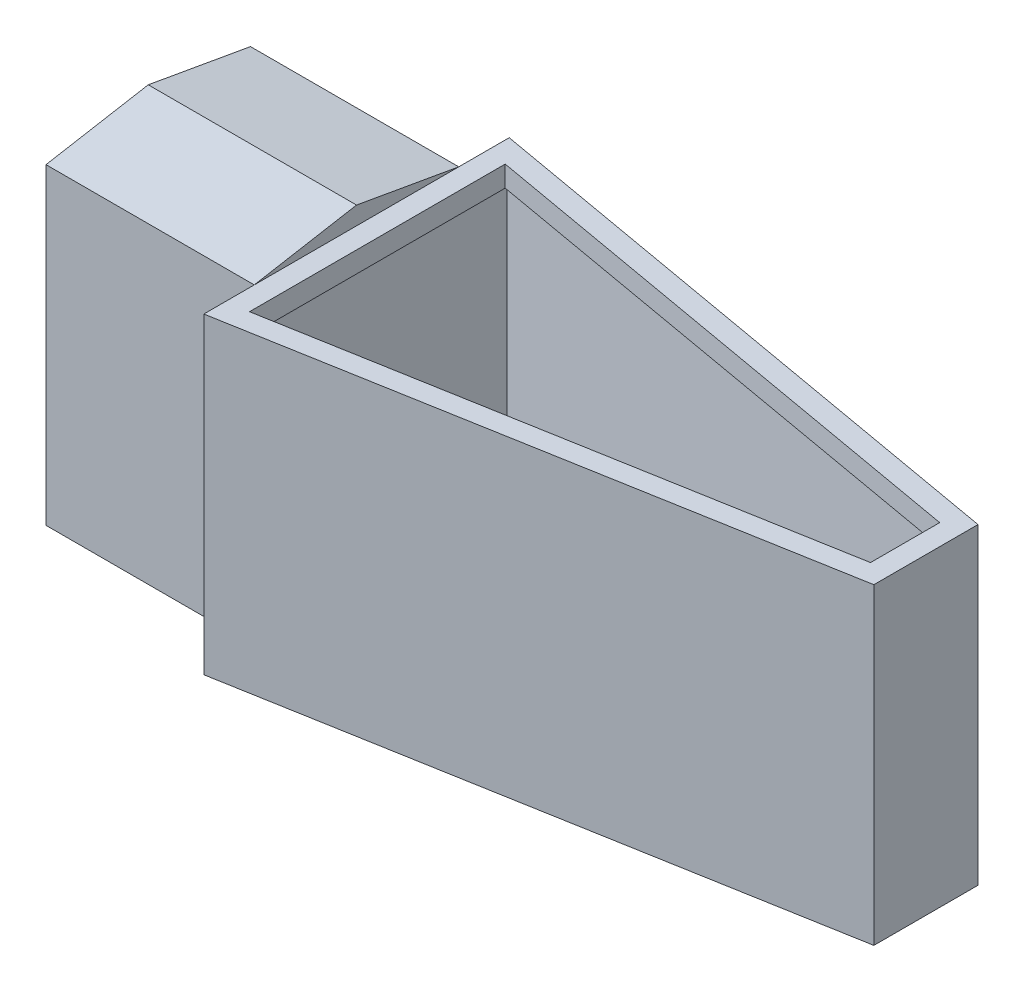
ISO-10303-21;
HEADER;
FILE_DESCRIPTION(('STEP AP214'),'2;1');
FILE_NAME('part.step','',(''),(''),'','','');
FILE_SCHEMA(('AUTOMOTIVE_DESIGN { 1 0 10303 214 1 1 1 1 }'));
ENDSEC;
DATA;
#1=APPLICATION_CONTEXT('core data for automotive mechanical design processes');
#2=APPLICATION_PROTOCOL_DEFINITION('international standard','automotive_design',2000,#1);
#3=PRODUCT_CONTEXT('',#1,'mechanical');
#4=PRODUCT('Part','Part','',(#3));
#5=PRODUCT_RELATED_PRODUCT_CATEGORY('part','',(#4));
#6=PRODUCT_DEFINITION_FORMATION('','',#4);
#7=PRODUCT_DEFINITION_CONTEXT('part definition',#1,'design');
#8=PRODUCT_DEFINITION('design','',#6,#7);
#9=PRODUCT_DEFINITION_SHAPE('','',#8);
#10=(LENGTH_UNIT() NAMED_UNIT(*) SI_UNIT(.MILLI.,.METRE.));
#11=(NAMED_UNIT(*) PLANE_ANGLE_UNIT() SI_UNIT($,.RADIAN.));
#12=(NAMED_UNIT(*) SI_UNIT($,.STERADIAN.) SOLID_ANGLE_UNIT());
#13=UNCERTAINTY_MEASURE_WITH_UNIT(LENGTH_MEASURE(1.E-05),#10,'distance_accuracy_value','');
#14=(GEOMETRIC_REPRESENTATION_CONTEXT(3) GLOBAL_UNCERTAINTY_ASSIGNED_CONTEXT((#13)) GLOBAL_UNIT_ASSIGNED_CONTEXT((#10,
#11,#12)) REPRESENTATION_CONTEXT('',''));
#15=CARTESIAN_POINT('',(0.,0.,0.));
#16=DIRECTION('',(0.,0.,1.));
#17=DIRECTION('',(1.,0.,0.));
#18=AXIS2_PLACEMENT_3D('',#15,#16,#17);
#19=CARTESIAN_POINT('',(12.8538089551144,38.1,-0.174987325087056));
#20=DIRECTION('',(1.,0.,0.));
#21=DIRECTION('',(0.,0.,-1.));
#22=AXIS2_PLACEMENT_3D('',#19,#20,#21);
#23=PLANE('',#22);
#24=DIRECTION('',(0.,-1.,0.));
#25=VECTOR('',#24,1.);
#26=CARTESIAN_POINT('',(12.8538089551144,0.,-31.26502256));
#27=LINE('',#26,#25);
#28=CARTESIAN_POINT('',(12.8538089551144,38.1,-31.26502256));
#29=VERTEX_POINT('',#28);
#30=CARTESIAN_POINT('',(12.8538089551144,0.,-31.2650225599999));
#31=VERTEX_POINT('',#30);
#32=EDGE_CURVE('E54',#29,#31,#27,.T.);
#33=ORIENTED_EDGE('',*,*,#32,.F.);
#34=DIRECTION('',(0.,0.,1.));
#35=VECTOR('',#34,1.);
#36=CARTESIAN_POINT('',(12.8538089551144,38.1,-0.174987325087056));
#37=LINE('',#36,#35);
#38=CARTESIAN_POINT('',(12.8538089551144,38.1,-37.417012674913));
#39=VERTEX_POINT('',#38);
#40=EDGE_CURVE('E286',#39,#29,#37,.T.);
#41=ORIENTED_EDGE('',*,*,#40,.F.);
#42=DIRECTION('',(0.,-1.,0.));
#43=VECTOR('',#42,1.);
#44=CARTESIAN_POINT('',(12.8538089551144,38.1,-37.417012674913));
#45=LINE('',#44,#43);
#46=CARTESIAN_POINT('',(12.8538089551144,0.,-37.417012674913));
#47=VERTEX_POINT('',#46);
#48=EDGE_CURVE('E12',#39,#47,#45,.T.);
#49=ORIENTED_EDGE('',*,*,#48,.T.);
#50=DIRECTION('',(0.,0.,1.));
#51=VECTOR('',#50,1.);
#52=CARTESIAN_POINT('',(12.8538089551144,0.,-0.174987325087056));
#53=LINE('',#52,#51);
#54=EDGE_CURVE('E298',#47,#31,#53,.T.);
#55=ORIENTED_EDGE('',*,*,#54,.T.);
#56=EDGE_LOOP('',(#33,#41,#49,#55));
#57=FACE_BOUND('',#56,.T.);
#58=ADVANCED_FACE('F39',(#57),#23,.F.);
#59=DIRECTION('',(0.,1.,0.));
#60=VECTOR('',#59,1.);
#61=CARTESIAN_POINT('',(12.8538089551144,0.,-6.32697744));
#62=LINE('',#61,#60);
#63=CARTESIAN_POINT('',(12.8538089551144,0.,-6.32697744));
#64=VERTEX_POINT('',#63);
#65=CARTESIAN_POINT('',(12.8538089551144,38.1,-6.32697744));
#66=VERTEX_POINT('',#65);
#67=EDGE_CURVE('E203',#64,#66,#62,.T.);
#68=ORIENTED_EDGE('',*,*,#67,.F.);
#69=CARTESIAN_POINT('',(12.8538089551144,0.,-0.174987325087056));
#70=VERTEX_POINT('',#69);
#71=EDGE_CURVE('E297',#64,#70,#53,.T.);
#72=ORIENTED_EDGE('',*,*,#71,.T.);
#73=DIRECTION('',(0.,-1.,0.));
#74=VECTOR('',#73,1.);
#75=CARTESIAN_POINT('',(12.8538089551144,38.1,-0.174987325087056));
#76=LINE('',#75,#74);
#77=CARTESIAN_POINT('',(12.8538089551144,38.1,-0.174987325087056));
#78=VERTEX_POINT('',#77);
#79=EDGE_CURVE('E47',#78,#70,#76,.T.);
#80=ORIENTED_EDGE('',*,*,#79,.F.);
#81=EDGE_CURVE('E284',#66,#78,#37,.T.);
#82=ORIENTED_EDGE('',*,*,#81,.F.);
#83=EDGE_LOOP('',(#68,#72,#80,#82));
#84=FACE_BOUND('',#83,.T.);
#85=ADVANCED_FACE('F337',(#84),#23,.F.);
#86=CARTESIAN_POINT('',(0.,38.1,0.));
#87=DIRECTION('',(0.,-1.,0.));
#88=DIRECTION('',(0.,0.,-1.));
#89=AXIS2_PLACEMENT_3D('',#86,#87,#88);
#90=PLANE('',#89);
#91=DIRECTION('',(-0.984743468318978,0.,-0.174012360489451));
#92=VECTOR('',#91,1.);
#93=CARTESIAN_POINT('',(82.2959999999999,38.1,-25.146));
#94=LINE('',#93,#92);
#95=CARTESIAN_POINT('',(82.2959999999999,38.1,-25.146));
#96=VERTEX_POINT('',#95);
#97=EDGE_CURVE('E281',#96,#39,#94,.T.);
#98=ORIENTED_EDGE('',*,*,#97,.T.);
#99=ORIENTED_EDGE('',*,*,#40,.T.);
#100=EDGE_CURVE('E290',#29,#66,#37,.T.);
#101=ORIENTED_EDGE('',*,*,#100,.T.);
#102=ORIENTED_EDGE('',*,*,#81,.T.);
#103=DIRECTION('',(0.984743468318978,0.,-0.17401236048945));
#104=VECTOR('',#103,1.);
#105=CARTESIAN_POINT('',(82.2959999999999,38.1,-12.446));
#106=LINE('',#105,#104);
#107=CARTESIAN_POINT('',(82.2959999999999,38.1,-12.446));
#108=VERTEX_POINT('',#107);
#109=EDGE_CURVE('E289',#78,#108,#106,.T.);
#110=ORIENTED_EDGE('',*,*,#109,.T.);
#111=DIRECTION('',(0.,0.,-1.));
#112=VECTOR('',#111,1.);
#113=CARTESIAN_POINT('',(82.2959999999999,38.1,-12.446));
#114=LINE('',#113,#112);
#115=EDGE_CURVE('E292',#108,#96,#114,.T.);
#116=ORIENTED_EDGE('',*,*,#115,.T.);
#117=EDGE_LOOP('',(#98,#99,#101,#102,#110,#116));
#118=FACE_BOUND('',#117,.T.);
#119=DIRECTION('',(0.,0.,-1.));
#120=VECTOR('',#119,1.);
#121=CARTESIAN_POINT('',(15.3938089551144,38.1,-34.3888215859853));
#122=LINE('',#121,#120);
#123=CARTESIAN_POINT('',(15.3938089551144,38.1,-3.20317841401467));
#124=VERTEX_POINT('',#123);
#125=CARTESIAN_POINT('',(15.3938089551144,38.1,-34.3888215859853));
#126=VERTEX_POINT('',#125);
#127=EDGE_CURVE('E255',#124,#126,#122,.T.);
#128=ORIENTED_EDGE('',*,*,#127,.T.);
#129=DIRECTION('',(0.984743468318978,0.,0.174012360489451));
#130=VECTOR('',#129,1.);
#131=CARTESIAN_POINT('',(79.7559999999999,38.1,-23.0154871589875));
#132=LINE('',#131,#130);
#133=CARTESIAN_POINT('',(79.7559999999999,38.1,-23.0154871589875));
#134=VERTEX_POINT('',#133);
#135=EDGE_CURVE('E251',#126,#134,#132,.T.);
#136=ORIENTED_EDGE('',*,*,#135,.T.);
#137=DIRECTION('',(0.,0.,1.));
#138=VECTOR('',#137,1.);
#139=CARTESIAN_POINT('',(79.7559999999999,38.1,-14.5765128410125));
#140=LINE('',#139,#138);
#141=CARTESIAN_POINT('',(79.7559999999999,38.1,-14.5765128410125));
#142=VERTEX_POINT('',#141);
#143=EDGE_CURVE('E254',#134,#142,#140,.T.);
#144=ORIENTED_EDGE('',*,*,#143,.T.);
#145=DIRECTION('',(-0.984743468318978,0.,0.17401236048945));
#146=VECTOR('',#145,1.);
#147=CARTESIAN_POINT('',(15.3938089551144,38.1,-3.20317841401467));
#148=LINE('',#147,#146);
#149=EDGE_CURVE('E258',#142,#124,#148,.T.);
#150=ORIENTED_EDGE('',*,*,#149,.T.);
#151=EDGE_LOOP('',(#128,#136,#144,#150));
#152=FACE_BOUND('',#151,.T.);
#153=ADVANCED_FACE('F333',(#118,#152),#90,.F.);
#154=CARTESIAN_POINT('',(82.2959999999999,38.1,-25.146));
#155=DIRECTION('',(-0.174012360489451,0.,0.984743468318978));
#156=DIRECTION('',(0.984743468318978,0.,0.174012360489451));
#157=AXIS2_PLACEMENT_3D('',#154,#155,#156);
#158=PLANE('',#157);
#159=DIRECTION('',(-0.984743468318978,0.,-0.174012360489451));
#160=VECTOR('',#159,1.);
#161=CARTESIAN_POINT('',(82.2959999999999,0.,-25.146));
#162=LINE('',#161,#160);
#163=CARTESIAN_POINT('',(82.2959999999999,0.,-25.146));
#164=VERTEX_POINT('',#163);
#165=EDGE_CURVE('E261',#164,#47,#162,.T.);
#166=ORIENTED_EDGE('',*,*,#165,.T.);
#167=ORIENTED_EDGE('',*,*,#48,.F.);
#168=ORIENTED_EDGE('',*,*,#97,.F.);
#169=DIRECTION('',(0.,-1.,0.));
#170=VECTOR('',#169,1.);
#171=CARTESIAN_POINT('',(82.2959999999999,38.1,-25.146));
#172=LINE('',#171,#170);
#173=EDGE_CURVE('E294',#96,#164,#172,.T.);
#174=ORIENTED_EDGE('',*,*,#173,.T.);
#175=EDGE_LOOP('',(#166,#167,#168,#174));
#176=FACE_BOUND('',#175,.T.);
#177=ADVANCED_FACE('F41',(#176),#158,.F.);
#178=EDGE_CURVE('E302',#31,#64,#53,.T.);
#179=ORIENTED_EDGE('',*,*,#178,.T.);
#180=DIRECTION('',(0.,0.173648177666934,-0.984807753012208));
#181=VECTOR('',#180,1.);
#182=CARTESIAN_POINT('',(12.8538089551144,-1.08197686542356,-0.19078171387655));
#183=LINE('',#182,#181);
#184=CARTESIAN_POINT('',(12.8538089551144,2.19862510039056,-18.7959999999999));
#185=VERTEX_POINT('',#184);
#186=EDGE_CURVE('E200',#64,#185,#183,.T.);
#187=ORIENTED_EDGE('',*,*,#186,.T.);
#188=DIRECTION('',(0.,-0.173648177666931,-0.984807753012208));
#189=VECTOR('',#188,1.);
#190=CARTESIAN_POINT('',(12.8538089551144,5.34663374852575,-0.942755785831534));
#191=LINE('',#190,#189);
#192=EDGE_CURVE('E198',#185,#31,#191,.T.);
#193=ORIENTED_EDGE('',*,*,#192,.T.);
#194=EDGE_LOOP('',(#179,#187,#193));
#195=FACE_BOUND('',#194,.T.);
#196=ADVANCED_FACE('F355',(#195),#23,.F.);
#197=CARTESIAN_POINT('',(82.2959999999999,38.1,-12.446));
#198=DIRECTION('',(-0.17401236048945,0.,-0.984743468318978));
#199=DIRECTION('',(-0.984743468318978,0.,0.17401236048945));
#200=AXIS2_PLACEMENT_3D('',#197,#198,#199);
#201=PLANE('',#200);
#202=DIRECTION('',(0.984743468318978,0.,-0.17401236048945));
#203=VECTOR('',#202,1.);
#204=CARTESIAN_POINT('',(82.2959999999999,0.,-12.446));
#205=LINE('',#204,#203);
#206=CARTESIAN_POINT('',(82.2959999999999,0.,-12.446));
#207=VERTEX_POINT('',#206);
#208=EDGE_CURVE('E301',#70,#207,#205,.T.);
#209=ORIENTED_EDGE('',*,*,#208,.T.);
#210=DIRECTION('',(0.,-1.,0.));
#211=VECTOR('',#210,1.);
#212=CARTESIAN_POINT('',(82.2959999999999,38.1,-12.446));
#213=LINE('',#212,#211);
#214=EDGE_CURVE('E307',#108,#207,#213,.T.);
#215=ORIENTED_EDGE('',*,*,#214,.F.);
#216=ORIENTED_EDGE('',*,*,#109,.F.);
#217=ORIENTED_EDGE('',*,*,#79,.T.);
#218=EDGE_LOOP('',(#209,#215,#216,#217));
#219=FACE_BOUND('',#218,.T.);
#220=ADVANCED_FACE('F314',(#219),#201,.F.);
#221=CARTESIAN_POINT('',(82.2959999999999,38.1,-12.446));
#222=DIRECTION('',(-1.,0.,0.));
#223=DIRECTION('',(0.,0.,1.));
#224=AXIS2_PLACEMENT_3D('',#221,#222,#223);
#225=PLANE('',#224);
#226=DIRECTION('',(0.,0.,-1.));
#227=VECTOR('',#226,1.);
#228=CARTESIAN_POINT('',(82.2959999999999,0.,-12.446));
#229=LINE('',#228,#227);
#230=EDGE_CURVE('E285',#207,#164,#229,.T.);
#231=ORIENTED_EDGE('',*,*,#230,.T.);
#232=ORIENTED_EDGE('',*,*,#173,.F.);
#233=ORIENTED_EDGE('',*,*,#115,.F.);
#234=ORIENTED_EDGE('',*,*,#214,.T.);
#235=EDGE_LOOP('',(#231,#232,#233,#234));
#236=FACE_BOUND('',#235,.T.);
#237=ADVANCED_FACE('F327',(#236),#225,.F.);
#238=CARTESIAN_POINT('',(0.,0.,0.));
#239=DIRECTION('',(0.,-1.,0.));
#240=DIRECTION('',(0.,0.,-1.));
#241=AXIS2_PLACEMENT_3D('',#238,#239,#240);
#242=PLANE('',#241);
#243=ORIENTED_EDGE('',*,*,#165,.F.);
#244=ORIENTED_EDGE('',*,*,#230,.F.);
#245=ORIENTED_EDGE('',*,*,#208,.F.);
#246=ORIENTED_EDGE('',*,*,#71,.F.);
#247=ORIENTED_EDGE('',*,*,#178,.F.);
#248=ORIENTED_EDGE('',*,*,#54,.F.);
#249=EDGE_LOOP('',(#243,#244,#245,#246,#247,#248));
#250=FACE_BOUND('',#249,.T.);
#251=ADVANCED_FACE('F322',(#250),#242,.T.);
#252=CARTESIAN_POINT('',(15.3938089551144,109.619479697127,-34.3888215859853));
#253=DIRECTION('',(1.,0.,0.));
#254=DIRECTION('',(0.,0.,-1.));
#255=AXIS2_PLACEMENT_3D('',#252,#253,#254);
#256=PLANE('',#255);
#257=DIRECTION('',(0.,-1.,0.));
#258=VECTOR('',#257,1.);
#259=CARTESIAN_POINT('',(15.3938089551144,109.619479697127,-3.20317841401467));
#260=LINE('',#259,#258);
#261=CARTESIAN_POINT('',(15.3938089551144,35.56,-3.20317841401467));
#262=VERTEX_POINT('',#261);
#263=EDGE_CURVE('E62',#124,#262,#260,.T.);
#264=ORIENTED_EDGE('',*,*,#263,.T.);
#265=DIRECTION('',(0.,0.,1.));
#266=VECTOR('',#265,1.);
#267=CARTESIAN_POINT('',(15.3938089551144,35.56,-34.3888215859853));
#268=LINE('',#267,#266);
#269=CARTESIAN_POINT('',(15.3938089551144,35.56,-34.3888215859853));
#270=VERTEX_POINT('',#269);
#271=EDGE_CURVE('E267',#270,#262,#268,.T.);
#272=ORIENTED_EDGE('',*,*,#271,.F.);
#273=DIRECTION('',(0.,-1.,0.));
#274=VECTOR('',#273,1.);
#275=CARTESIAN_POINT('',(15.3938089551144,109.619479697127,-34.3888215859853));
#276=LINE('',#275,#274);
#277=EDGE_CURVE('E270',#126,#270,#276,.T.);
#278=ORIENTED_EDGE('',*,*,#277,.F.);
#279=ORIENTED_EDGE('',*,*,#127,.F.);
#280=EDGE_LOOP('',(#264,#272,#278,#279));
#281=FACE_BOUND('',#280,.T.);
#282=ADVANCED_FACE('F389',(#281),#256,.T.);
#283=CARTESIAN_POINT('',(79.7559999999999,109.619479697127,-23.0154871589875));
#284=DIRECTION('',(-0.174012360489451,0.,0.984743468318978));
#285=DIRECTION('',(0.984743468318978,0.,0.174012360489451));
#286=AXIS2_PLACEMENT_3D('',#283,#284,#285);
#287=PLANE('',#286);
#288=ORIENTED_EDGE('',*,*,#277,.T.);
#289=DIRECTION('',(-0.984743468318978,0.,-0.174012360489451));
#290=VECTOR('',#289,1.);
#291=CARTESIAN_POINT('',(79.7559999999999,35.56,-23.0154871589875));
#292=LINE('',#291,#290);
#293=CARTESIAN_POINT('',(79.7559999999999,35.56,-23.0154871589875));
#294=VERTEX_POINT('',#293);
#295=EDGE_CURVE('E265',#294,#270,#292,.T.);
#296=ORIENTED_EDGE('',*,*,#295,.F.);
#297=DIRECTION('',(0.,-1.,0.));
#298=VECTOR('',#297,1.);
#299=CARTESIAN_POINT('',(79.7559999999999,109.619479697127,-23.0154871589875));
#300=LINE('',#299,#298);
#301=EDGE_CURVE('E273',#134,#294,#300,.T.);
#302=ORIENTED_EDGE('',*,*,#301,.F.);
#303=ORIENTED_EDGE('',*,*,#135,.F.);
#304=EDGE_LOOP('',(#288,#296,#302,#303));
#305=FACE_BOUND('',#304,.T.);
#306=ADVANCED_FACE('F409',(#305),#287,.T.);
#307=CARTESIAN_POINT('',(79.7559999999999,109.619479697127,-14.5765128410125));
#308=DIRECTION('',(-1.,0.,0.));
#309=DIRECTION('',(0.,0.,1.));
#310=AXIS2_PLACEMENT_3D('',#307,#308,#309);
#311=PLANE('',#310);
#312=ORIENTED_EDGE('',*,*,#301,.T.);
#313=DIRECTION('',(0.,0.,-1.));
#314=VECTOR('',#313,1.);
#315=CARTESIAN_POINT('',(79.7559999999999,35.56,-14.5765128410125));
#316=LINE('',#315,#314);
#317=CARTESIAN_POINT('',(79.7559999999999,35.56,-14.5765128410125));
#318=VERTEX_POINT('',#317);
#319=EDGE_CURVE('E263',#318,#294,#316,.T.);
#320=ORIENTED_EDGE('',*,*,#319,.F.);
#321=DIRECTION('',(0.,-1.,0.));
#322=VECTOR('',#321,1.);
#323=CARTESIAN_POINT('',(79.7559999999999,109.619479697127,-14.5765128410125));
#324=LINE('',#323,#322);
#325=EDGE_CURVE('E276',#142,#318,#324,.T.);
#326=ORIENTED_EDGE('',*,*,#325,.F.);
#327=ORIENTED_EDGE('',*,*,#143,.F.);
#328=EDGE_LOOP('',(#312,#320,#326,#327));
#329=FACE_BOUND('',#328,.T.);
#330=ADVANCED_FACE('F417',(#329),#311,.T.);
#331=CARTESIAN_POINT('',(15.3938089551144,109.619479697127,-3.20317841401467));
#332=DIRECTION('',(-0.17401236048945,0.,-0.984743468318978));
#333=DIRECTION('',(-0.984743468318978,0.,0.17401236048945));
#334=AXIS2_PLACEMENT_3D('',#331,#332,#333);
#335=PLANE('',#334);
#336=ORIENTED_EDGE('',*,*,#325,.T.);
#337=DIRECTION('',(0.984743468318978,0.,-0.17401236048945));
#338=VECTOR('',#337,1.);
#339=CARTESIAN_POINT('',(15.3938089551144,35.56,-3.20317841401467));
#340=LINE('',#339,#338);
#341=EDGE_CURVE('E250',#262,#318,#340,.T.);
#342=ORIENTED_EDGE('',*,*,#341,.F.);
#343=ORIENTED_EDGE('',*,*,#263,.F.);
#344=ORIENTED_EDGE('',*,*,#149,.F.);
#345=EDGE_LOOP('',(#336,#342,#343,#344));
#346=FACE_BOUND('',#345,.T.);
#347=ADVANCED_FACE('F386',(#346),#335,.T.);
#348=CARTESIAN_POINT('',(0.,1.27,0.));
#349=DIRECTION('',(0.,-1.,0.));
#350=DIRECTION('',(0.,0.,-1.));
#351=AXIS2_PLACEMENT_3D('',#348,#349,#350);
#352=PLANE('',#351);
#353=DIRECTION('',(0.984743468318978,0.,-0.17401236048945));
#354=VECTOR('',#353,1.);
#355=CARTESIAN_POINT('',(14.1238089551144,1.26999999999999,-1.68908286955086));
#356=LINE('',#355,#354);
#357=CARTESIAN_POINT('',(14.1238089551144,1.26999999999998,-1.68908286955086));
#358=VERTEX_POINT('',#357);
#359=CARTESIAN_POINT('',(81.0259999999999,1.26999999999998,-13.5112564205063));
#360=VERTEX_POINT('',#359);
#361=EDGE_CURVE('E234',#358,#360,#356,.T.);
#362=ORIENTED_EDGE('',*,*,#361,.T.);
#363=DIRECTION('',(0.,0.,-1.));
#364=VECTOR('',#363,1.);
#365=CARTESIAN_POINT('',(81.0259999999999,1.26999999999998,-13.5112564205063));
#366=LINE('',#365,#364);
#367=CARTESIAN_POINT('',(81.0259999999999,1.26999999999995,-24.0807435794937));
#368=VERTEX_POINT('',#367);
#369=EDGE_CURVE('E222',#360,#368,#366,.T.);
#370=ORIENTED_EDGE('',*,*,#369,.T.);
#371=DIRECTION('',(-0.984743468318978,0.,-0.174012360489451));
#372=VECTOR('',#371,1.);
#373=CARTESIAN_POINT('',(81.0259999999999,1.26999999999998,-24.0807435794937));
#374=LINE('',#373,#372);
#375=CARTESIAN_POINT('',(14.1238089551144,1.26999999999998,-35.9029171304491));
#376=VERTEX_POINT('',#375);
#377=EDGE_CURVE('E243',#368,#376,#374,.T.);
#378=ORIENTED_EDGE('',*,*,#377,.T.);
#379=DIRECTION('',(0.,0.,1.));
#380=VECTOR('',#379,1.);
#381=CARTESIAN_POINT('',(14.1238089551144,1.26999999999998,-35.9029171304491));
#382=LINE('',#381,#380);
#383=EDGE_CURVE('E239',#376,#358,#382,.T.);
#384=ORIENTED_EDGE('',*,*,#383,.T.);
#385=EDGE_LOOP('',(#362,#370,#378,#384));
#386=FACE_BOUND('',#385,.T.);
#387=ADVANCED_FACE('F431',(#386),#352,.F.);
#388=CARTESIAN_POINT('',(0.,35.56,0.));
#389=DIRECTION('',(0.,1.,0.));
#390=DIRECTION('',(0.,0.,1.));
#391=AXIS2_PLACEMENT_3D('',#388,#389,#390);
#392=PLANE('',#391);
#393=ORIENTED_EDGE('',*,*,#341,.T.);
#394=ORIENTED_EDGE('',*,*,#319,.T.);
#395=ORIENTED_EDGE('',*,*,#295,.T.);
#396=ORIENTED_EDGE('',*,*,#271,.T.);
#397=EDGE_LOOP('',(#393,#394,#395,#396));
#398=FACE_BOUND('',#397,.T.);
#399=DIRECTION('',(0.984743468318978,0.,-0.17401236048945));
#400=VECTOR('',#399,1.);
#401=CARTESIAN_POINT('',(14.1238089551144,35.56,-1.68908286955086));
#402=LINE('',#401,#400);
#403=CARTESIAN_POINT('',(14.1238089551144,35.56,-1.68908286955086));
#404=VERTEX_POINT('',#403);
#405=CARTESIAN_POINT('',(81.0259999999999,35.56,-13.5112564205063));
#406=VERTEX_POINT('',#405);
#407=EDGE_CURVE('E183',#404,#406,#402,.T.);
#408=ORIENTED_EDGE('',*,*,#407,.F.);
#409=DIRECTION('',(0.,0.,1.));
#410=VECTOR('',#409,1.);
#411=CARTESIAN_POINT('',(14.1238089551144,35.56,-35.9029171304491));
#412=LINE('',#411,#410);
#413=CARTESIAN_POINT('',(14.1238089551144,35.56,-35.9029171304491));
#414=VERTEX_POINT('',#413);
#415=EDGE_CURVE('E219',#414,#404,#412,.T.);
#416=ORIENTED_EDGE('',*,*,#415,.F.);
#417=DIRECTION('',(-0.984743468318978,0.,-0.174012360489451));
#418=VECTOR('',#417,1.);
#419=CARTESIAN_POINT('',(81.0259999999999,35.56,-24.0807435794937));
#420=LINE('',#419,#418);
#421=CARTESIAN_POINT('',(81.0259999999999,35.56,-24.0807435794937));
#422=VERTEX_POINT('',#421);
#423=EDGE_CURVE('E223',#422,#414,#420,.T.);
#424=ORIENTED_EDGE('',*,*,#423,.F.);
#425=DIRECTION('',(0.,0.,-1.));
#426=VECTOR('',#425,1.);
#427=CARTESIAN_POINT('',(81.0259999999999,35.56,-13.5112564205063));
#428=LINE('',#427,#426);
#429=EDGE_CURVE('E226',#406,#422,#428,.T.);
#430=ORIENTED_EDGE('',*,*,#429,.F.);
#431=EDGE_LOOP('',(#408,#416,#424,#430));
#432=FACE_BOUND('',#431,.T.);
#433=ADVANCED_FACE('F437',(#398,#432),#392,.F.);
#434=CARTESIAN_POINT('',(81.0259999999999,-75.1431275729097,-13.5112564205063));
#435=DIRECTION('',(1.,0.,0.));
#436=DIRECTION('',(0.,0.,-1.));
#437=AXIS2_PLACEMENT_3D('',#434,#435,#436);
#438=PLANE('',#437);
#439=DIRECTION('',(0.,1.,0.));
#440=VECTOR('',#439,1.);
#441=CARTESIAN_POINT('',(81.0259999999999,-75.1431275729097,-13.5112564205063));
#442=LINE('',#441,#440);
#443=EDGE_CURVE('E237',#360,#406,#442,.T.);
#444=ORIENTED_EDGE('',*,*,#443,.T.);
#445=ORIENTED_EDGE('',*,*,#429,.T.);
#446=DIRECTION('',(0.,1.,0.));
#447=VECTOR('',#446,1.);
#448=CARTESIAN_POINT('',(81.0259999999999,-75.1431275729097,-24.0807435794937));
#449=LINE('',#448,#447);
#450=EDGE_CURVE('E233',#368,#422,#449,.T.);
#451=ORIENTED_EDGE('',*,*,#450,.F.);
#452=ORIENTED_EDGE('',*,*,#369,.F.);
#453=EDGE_LOOP('',(#444,#445,#451,#452));
#454=FACE_BOUND('',#453,.T.);
#455=ADVANCED_FACE('F445',(#454),#438,.F.);
#456=CARTESIAN_POINT('',(81.0259999999999,-75.1431275729097,-24.0807435794937));
#457=DIRECTION('',(0.174012360489451,0.,-0.984743468318978));
#458=DIRECTION('',(-0.984743468318978,0.,-0.174012360489451));
#459=AXIS2_PLACEMENT_3D('',#456,#457,#458);
#460=PLANE('',#459);
#461=ORIENTED_EDGE('',*,*,#450,.T.);
#462=ORIENTED_EDGE('',*,*,#423,.T.);
#463=DIRECTION('',(0.,1.,0.));
#464=VECTOR('',#463,1.);
#465=CARTESIAN_POINT('',(14.1238089551144,-75.1431275729097,-35.9029171304491));
#466=LINE('',#465,#464);
#467=EDGE_CURVE('E242',#376,#414,#466,.T.);
#468=ORIENTED_EDGE('',*,*,#467,.F.);
#469=ORIENTED_EDGE('',*,*,#377,.F.);
#470=EDGE_LOOP('',(#461,#462,#468,#469));
#471=FACE_BOUND('',#470,.T.);
#472=ADVANCED_FACE('F453',(#471),#460,.F.);
#473=CARTESIAN_POINT('',(14.1238089551144,-75.1431275729097,-35.9029171304491));
#474=DIRECTION('',(-1.,0.,0.));
#475=DIRECTION('',(0.,0.,1.));
#476=AXIS2_PLACEMENT_3D('',#473,#474,#475);
#477=PLANE('',#476);
#478=ORIENTED_EDGE('',*,*,#467,.T.);
#479=ORIENTED_EDGE('',*,*,#415,.T.);
#480=DIRECTION('',(0.,1.,0.));
#481=VECTOR('',#480,1.);
#482=CARTESIAN_POINT('',(14.1238089551144,-75.1431275729097,-1.68908286955086));
#483=LINE('',#482,#481);
#484=EDGE_CURVE('E238',#358,#404,#483,.T.);
#485=ORIENTED_EDGE('',*,*,#484,.F.);
#486=ORIENTED_EDGE('',*,*,#383,.F.);
#487=EDGE_LOOP('',(#478,#479,#485,#486));
#488=FACE_BOUND('',#487,.T.);
#489=ADVANCED_FACE('F461',(#488),#477,.F.);
#490=CARTESIAN_POINT('',(14.1238089551144,-75.1431275729097,-1.68908286955086));
#491=DIRECTION('',(0.17401236048945,0.,0.984743468318978));
#492=DIRECTION('',(0.984743468318978,0.,-0.17401236048945));
#493=AXIS2_PLACEMENT_3D('',#490,#491,#492);
#494=PLANE('',#493);
#495=ORIENTED_EDGE('',*,*,#484,.T.);
#496=ORIENTED_EDGE('',*,*,#407,.T.);
#497=ORIENTED_EDGE('',*,*,#443,.F.);
#498=ORIENTED_EDGE('',*,*,#361,.F.);
#499=EDGE_LOOP('',(#495,#496,#497,#498));
#500=FACE_BOUND('',#499,.T.);
#501=ADVANCED_FACE('F469',(#500),#494,.F.);
#502=CARTESIAN_POINT('',(-12.5461910448856,0.,-31.26502256));
#503=DIRECTION('',(0.,0.,1.));
#504=DIRECTION('',(0.,-1.,0.));
#505=AXIS2_PLACEMENT_3D('',#502,#503,#504);
#506=PLANE('',#505);
#507=ORIENTED_EDGE('',*,*,#32,.T.);
#508=DIRECTION('',(1.,0.,0.));
#509=VECTOR('',#508,1.);
#510=CARTESIAN_POINT('',(-12.5461910448856,0.,-31.26502256));
#511=LINE('',#510,#509);
#512=CARTESIAN_POINT('',(-12.5461910448856,0.,-31.26502256));
#513=VERTEX_POINT('',#512);
#514=EDGE_CURVE('E178',#513,#31,#511,.T.);
#515=ORIENTED_EDGE('',*,*,#514,.F.);
#516=DIRECTION('',(0.,-1.,0.));
#517=VECTOR('',#516,1.);
#518=CARTESIAN_POINT('',(-12.5461910448856,0.,-31.26502256));
#519=LINE('',#518,#517);
#520=CARTESIAN_POINT('',(-12.5461910448856,38.1,-31.26502256));
#521=VERTEX_POINT('',#520);
#522=EDGE_CURVE('E167',#521,#513,#519,.T.);
#523=ORIENTED_EDGE('',*,*,#522,.F.);
#524=DIRECTION('',(1.,0.,0.));
#525=VECTOR('',#524,1.);
#526=CARTESIAN_POINT('',(-12.5461910448856,38.1,-31.26502256));
#527=LINE('',#526,#525);
#528=EDGE_CURVE('E196',#521,#29,#527,.T.);
#529=ORIENTED_EDGE('',*,*,#528,.T.);
#530=EDGE_LOOP('',(#507,#515,#523,#529));
#531=FACE_BOUND('',#530,.T.);
#532=ADVANCED_FACE('F179',(#531),#506,.F.);
#533=CARTESIAN_POINT('',(-12.5461910448856,5.34663374852575,-0.942755785831534));
#534=DIRECTION('',(0.,-0.984807753012208,0.173648177666931));
#535=DIRECTION('',(0.,-0.173648177666931,-0.984807753012208));
#536=AXIS2_PLACEMENT_3D('',#533,#534,#535);
#537=PLANE('',#536);
#538=ORIENTED_EDGE('',*,*,#192,.F.);
#539=DIRECTION('',(1.,0.,0.));
#540=VECTOR('',#539,1.);
#541=CARTESIAN_POINT('',(-12.5461910448856,2.19862510039056,-18.7959999999999));
#542=LINE('',#541,#540);
#543=CARTESIAN_POINT('',(-12.5461910448856,2.19862510039056,-18.7959999999999));
#544=VERTEX_POINT('',#543);
#545=EDGE_CURVE('E184',#544,#185,#542,.T.);
#546=ORIENTED_EDGE('',*,*,#545,.F.);
#547=DIRECTION('',(0.,-0.173648177666931,-0.984807753012208));
#548=VECTOR('',#547,1.);
#549=CARTESIAN_POINT('',(-12.5461910448856,5.34663374852575,-0.942755785831534));
#550=LINE('',#549,#548);
#551=EDGE_CURVE('E171',#544,#513,#550,.T.);
#552=ORIENTED_EDGE('',*,*,#551,.T.);
#553=ORIENTED_EDGE('',*,*,#514,.T.);
#554=EDGE_LOOP('',(#538,#546,#552,#553));
#555=FACE_BOUND('',#554,.T.);
#556=ADVANCED_FACE('F186',(#555),#537,.T.);
#557=CARTESIAN_POINT('',(-12.5461910448856,-1.08197686542356,-0.19078171387655));
#558=DIRECTION('',(0.,-0.984807753012207,-0.173648177666934));
#559=DIRECTION('',(0.,0.173648177666934,-0.984807753012207));
#560=AXIS2_PLACEMENT_3D('',#557,#558,#559);
#561=PLANE('',#560);
#562=ORIENTED_EDGE('',*,*,#186,.F.);
#563=DIRECTION('',(1.,0.,0.));
#564=VECTOR('',#563,1.);
#565=CARTESIAN_POINT('',(-12.5461910448856,0.,-6.32697744));
#566=LINE('',#565,#564);
#567=CARTESIAN_POINT('',(-12.5461910448856,0.,-6.32697744));
#568=VERTEX_POINT('',#567);
#569=EDGE_CURVE('E216',#568,#64,#566,.T.);
#570=ORIENTED_EDGE('',*,*,#569,.F.);
#571=DIRECTION('',(0.,0.173648177666934,-0.984807753012208));
#572=VECTOR('',#571,1.);
#573=CARTESIAN_POINT('',(-12.5461910448856,-1.08197686542356,-0.19078171387655));
#574=LINE('',#573,#572);
#575=EDGE_CURVE('E187',#568,#544,#574,.T.);
#576=ORIENTED_EDGE('',*,*,#575,.T.);
#577=ORIENTED_EDGE('',*,*,#545,.T.);
#578=EDGE_LOOP('',(#562,#570,#576,#577));
#579=FACE_BOUND('',#578,.T.);
#580=ADVANCED_FACE('F357',(#579),#561,.T.);
#581=CARTESIAN_POINT('',(-12.5461910448856,0.,-6.32697744));
#582=DIRECTION('',(0.,0.,-1.));
#583=DIRECTION('',(0.,1.,0.));
#584=AXIS2_PLACEMENT_3D('',#581,#582,#583);
#585=PLANE('',#584);
#586=ORIENTED_EDGE('',*,*,#67,.T.);
#587=DIRECTION('',(1.,0.,0.));
#588=VECTOR('',#587,1.);
#589=CARTESIAN_POINT('',(-12.5461910448856,38.1,-6.32697744));
#590=LINE('',#589,#588);
#591=CARTESIAN_POINT('',(-12.5461910448856,38.1,-6.32697744));
#592=VERTEX_POINT('',#591);
#593=EDGE_CURVE('E213',#592,#66,#590,.T.);
#594=ORIENTED_EDGE('',*,*,#593,.F.);
#595=DIRECTION('',(0.,1.,0.));
#596=VECTOR('',#595,1.);
#597=CARTESIAN_POINT('',(-12.5461910448856,0.,-6.32697744));
#598=LINE('',#597,#596);
#599=EDGE_CURVE('E189',#568,#592,#598,.T.);
#600=ORIENTED_EDGE('',*,*,#599,.F.);
#601=ORIENTED_EDGE('',*,*,#569,.T.);
#602=EDGE_LOOP('',(#586,#594,#600,#601));
#603=FACE_BOUND('',#602,.T.);
#604=ADVANCED_FACE('F340',(#603),#585,.F.);
#605=CARTESIAN_POINT('',(-12.5461910448856,35.8691675605479,6.32470201647762));
#606=DIRECTION('',(0.,-0.984807753012207,-0.173648177666935));
#607=DIRECTION('',(0.,0.173648177666935,-0.984807753012207));
#608=AXIS2_PLACEMENT_3D('',#605,#606,#607);
#609=PLANE('',#608);
#610=DIRECTION('',(0.,0.173648177666935,-0.984807753012207));
#611=VECTOR('',#610,1.);
#612=CARTESIAN_POINT('',(12.8538089551144,35.8691675605479,6.32470201647762));
#613=LINE('',#612,#611);
#614=CARTESIAN_POINT('',(12.8538089551144,40.2986251003906,-18.7959999999999));
#615=VERTEX_POINT('',#614);
#616=EDGE_CURVE('E205',#66,#615,#613,.T.);
#617=ORIENTED_EDGE('',*,*,#616,.T.);
#618=DIRECTION('',(1.,0.,0.));
#619=VECTOR('',#618,1.);
#620=CARTESIAN_POINT('',(-12.5461910448856,40.2986251003906,-18.7959999999999));
#621=LINE('',#620,#619);
#622=CARTESIAN_POINT('',(-12.5461910448856,40.2986251003906,-18.7959999999999));
#623=VERTEX_POINT('',#622);
#624=EDGE_CURVE('E210',#623,#615,#621,.T.);
#625=ORIENTED_EDGE('',*,*,#624,.F.);
#626=DIRECTION('',(0.,0.173648177666935,-0.984807753012207));
#627=VECTOR('',#626,1.);
#628=CARTESIAN_POINT('',(-12.5461910448856,35.8691675605479,6.32470201647762));
#629=LINE('',#628,#627);
#630=EDGE_CURVE('E193',#592,#623,#629,.T.);
#631=ORIENTED_EDGE('',*,*,#630,.F.);
#632=ORIENTED_EDGE('',*,*,#593,.T.);
#633=EDGE_LOOP('',(#617,#625,#631,#632));
#634=FACE_BOUND('',#633,.T.);
#635=ADVANCED_FACE('F346',(#634),#609,.F.);
#636=CARTESIAN_POINT('',(-12.5461910448856,42.2977781744973,-7.45823951618551));
#637=DIRECTION('',(0.,-0.984807753012208,0.17364817766693));
#638=DIRECTION('',(0.,-0.17364817766693,-0.984807753012208));
#639=AXIS2_PLACEMENT_3D('',#636,#637,#638);
#640=PLANE('',#639);
#641=DIRECTION('',(0.,-0.17364817766693,-0.984807753012208));
#642=VECTOR('',#641,1.);
#643=CARTESIAN_POINT('',(12.8538089551144,42.2977781744973,-7.45823951618551));
#644=LINE('',#643,#642);
#645=EDGE_CURVE('E176',#615,#29,#644,.T.);
#646=ORIENTED_EDGE('',*,*,#645,.T.);
#647=ORIENTED_EDGE('',*,*,#528,.F.);
#648=DIRECTION('',(0.,-0.17364817766693,-0.984807753012208));
#649=VECTOR('',#648,1.);
#650=CARTESIAN_POINT('',(-12.5461910448856,42.2977781744973,-7.45823951618551));
#651=LINE('',#650,#649);
#652=EDGE_CURVE('E174',#623,#521,#651,.T.);
#653=ORIENTED_EDGE('',*,*,#652,.F.);
#654=ORIENTED_EDGE('',*,*,#624,.T.);
#655=EDGE_LOOP('',(#646,#647,#653,#654));
#656=FACE_BOUND('',#655,.T.);
#657=ADVANCED_FACE('F352',(#656),#640,.F.);
#658=CARTESIAN_POINT('',(-12.5461910448856,0.,0.));
#659=DIRECTION('',(-1.,0.,0.));
#660=DIRECTION('',(0.,0.,1.));
#661=AXIS2_PLACEMENT_3D('',#658,#659,#660);
#662=PLANE('',#661);
#663=ORIENTED_EDGE('',*,*,#522,.T.);
#664=ORIENTED_EDGE('',*,*,#551,.F.);
#665=ORIENTED_EDGE('',*,*,#575,.F.);
#666=ORIENTED_EDGE('',*,*,#599,.T.);
#667=ORIENTED_EDGE('',*,*,#630,.T.);
#668=ORIENTED_EDGE('',*,*,#652,.T.);
#669=EDGE_LOOP('',(#663,#664,#665,#666,#667,#668));
#670=FACE_BOUND('',#669,.T.);
#671=ADVANCED_FACE('F168',(#670),#662,.T.);
#672=CARTESIAN_POINT('',(12.8538089551144,0.,0.));
#673=DIRECTION('',(-1.,0.,0.));
#674=DIRECTION('',(0.,0.,1.));
#675=AXIS2_PLACEMENT_3D('',#672,#673,#674);
#676=PLANE('',#675);
#677=ORIENTED_EDGE('',*,*,#100,.F.);
#678=ORIENTED_EDGE('',*,*,#645,.F.);
#679=ORIENTED_EDGE('',*,*,#616,.F.);
#680=EDGE_LOOP('',(#677,#678,#679));
#681=FACE_BOUND('',#680,.T.);
#682=ADVANCED_FACE('F350',(#681),#676,.F.);
#683=CLOSED_SHELL('',(#58,#85,#153,#177,#196,#220,#237,#251,#282,#306,#330,#347,#387,#433,#455,
#472,#489,#501,#532,#556,#580,#604,#635,#657,#671,#682));
#684=MANIFOLD_SOLID_BREP('B2',#683);
#685=ADVANCED_BREP_SHAPE_REPRESENTATION('',(#18,#684),#14);
#686=SHAPE_DEFINITION_REPRESENTATION(#9,#685);
ENDSEC;
END-ISO-10303-21;
